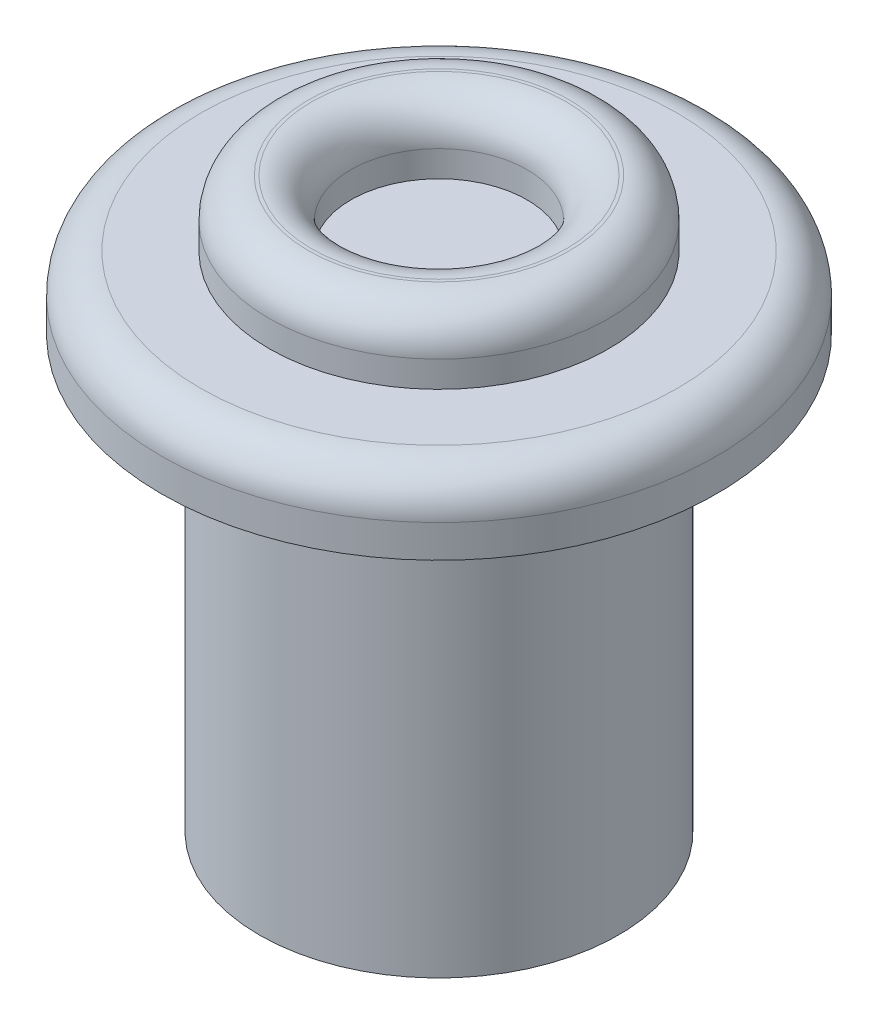
ISO-10303-21;
HEADER;
FILE_DESCRIPTION(('STEP AP214'),'2;1');
FILE_NAME('part.step','',(''),(''),'','','');
FILE_SCHEMA(('AUTOMOTIVE_DESIGN { 1 0 10303 214 1 1 1 1 }'));
ENDSEC;
DATA;
#1=APPLICATION_CONTEXT('core data for automotive mechanical design processes');
#2=APPLICATION_PROTOCOL_DEFINITION('international standard','automotive_design',2000,#1);
#3=PRODUCT_CONTEXT('',#1,'mechanical');
#4=PRODUCT('Part','Part','',(#3));
#5=PRODUCT_RELATED_PRODUCT_CATEGORY('part','',(#4));
#6=PRODUCT_DEFINITION_FORMATION('','',#4);
#7=PRODUCT_DEFINITION_CONTEXT('part definition',#1,'design');
#8=PRODUCT_DEFINITION('design','',#6,#7);
#9=PRODUCT_DEFINITION_SHAPE('','',#8);
#10=(LENGTH_UNIT() NAMED_UNIT(*) SI_UNIT(.MILLI.,.METRE.));
#11=(NAMED_UNIT(*) PLANE_ANGLE_UNIT() SI_UNIT($,.RADIAN.));
#12=(NAMED_UNIT(*) SI_UNIT($,.STERADIAN.) SOLID_ANGLE_UNIT());
#13=UNCERTAINTY_MEASURE_WITH_UNIT(LENGTH_MEASURE(1.E-05),#10,'distance_accuracy_value','');
#14=(GEOMETRIC_REPRESENTATION_CONTEXT(3) GLOBAL_UNCERTAINTY_ASSIGNED_CONTEXT((#13)) GLOBAL_UNIT_ASSIGNED_CONTEXT((#10,
#11,#12)) REPRESENTATION_CONTEXT('',''));
#15=CARTESIAN_POINT('',(0.,0.,0.));
#16=DIRECTION('',(0.,0.,1.));
#17=DIRECTION('',(1.,0.,0.));
#18=AXIS2_PLACEMENT_3D('',#15,#16,#17);
#19=CARTESIAN_POINT('',(0.,7.7,0.));
#20=DIRECTION('',(0.,1.,0.));
#21=DIRECTION('',(0.,0.,1.));
#22=AXIS2_PLACEMENT_3D('',#19,#20,#21);
#23=PLANE('',#22);
#24=CARTESIAN_POINT('',(0.,7.7,0.));
#25=DIRECTION('',(0.,1.,0.));
#26=DIRECTION('',(0.,0.,1.));
#27=AXIS2_PLACEMENT_3D('',#24,#25,#26);
#28=CIRCLE('',#27,3.65);
#29=CARTESIAN_POINT('',(0.,7.7,3.65));
#30=VERTEX_POINT('',#29);
#31=EDGE_CURVE('E38',#30,#30,#28,.T.);
#32=ORIENTED_EDGE('',*,*,#31,.T.);
#33=EDGE_LOOP('',(#32));
#34=FACE_BOUND('',#33,.T.);
#35=CARTESIAN_POINT('',(0.,7.7,0.));
#36=DIRECTION('',(0.,1.,0.));
#37=DIRECTION('',(0.,0.,1.));
#38=AXIS2_PLACEMENT_3D('',#35,#36,#37);
#39=CIRCLE('',#38,2.6);
#40=CARTESIAN_POINT('',(0.,7.7,2.6));
#41=VERTEX_POINT('',#40);
#42=EDGE_CURVE('E75',#41,#41,#39,.T.);
#43=ORIENTED_EDGE('',*,*,#42,.F.);
#44=EDGE_LOOP('',(#43));
#45=FACE_BOUND('',#44,.T.);
#46=ADVANCED_FACE('F31',(#34,#45),#23,.T.);
#47=CARTESIAN_POINT('',(0.,0.,0.));
#48=DIRECTION('',(0.,1.,0.));
#49=DIRECTION('',(0.,0.,1.));
#50=AXIS2_PLACEMENT_3D('',#47,#48,#49);
#51=PLANE('',#50);
#52=CARTESIAN_POINT('',(0.,0.,0.));
#53=DIRECTION('',(0.,1.,0.));
#54=DIRECTION('',(0.,0.,1.));
#55=AXIS2_PLACEMENT_3D('',#52,#53,#54);
#56=CIRCLE('',#55,2.75);
#57=CARTESIAN_POINT('',(0.,0.,2.75));
#58=VERTEX_POINT('',#57);
#59=EDGE_CURVE('E61',#58,#58,#56,.T.);
#60=ORIENTED_EDGE('',*,*,#59,.F.);
#61=EDGE_LOOP('',(#60));
#62=FACE_BOUND('',#61,.T.);
#63=CARTESIAN_POINT('',(0.,0.,0.));
#64=DIRECTION('',(0.,1.,0.));
#65=DIRECTION('',(0.,0.,1.));
#66=AXIS2_PLACEMENT_3D('',#63,#64,#65);
#67=CIRCLE('',#66,1.4);
#68=CARTESIAN_POINT('',(0.,0.,1.4));
#69=VERTEX_POINT('',#68);
#70=EDGE_CURVE('E64',#69,#69,#67,.T.);
#71=ORIENTED_EDGE('',*,*,#70,.T.);
#72=EDGE_LOOP('',(#71));
#73=FACE_BOUND('',#72,.T.);
#74=ADVANCED_FACE('F82',(#62,#73),#51,.F.);
#75=CARTESIAN_POINT('',(0.,6.6,0.));
#76=DIRECTION('',(0.,-1.,0.));
#77=DIRECTION('',(0.,0.,-1.));
#78=AXIS2_PLACEMENT_3D('',#75,#76,#77);
#79=CYLINDRICAL_SURFACE('',#78,2.75);
#80=CARTESIAN_POINT('',(0.,6.6,0.));
#81=DIRECTION('',(0.,1.,0.));
#82=DIRECTION('',(0.,0.,1.));
#83=AXIS2_PLACEMENT_3D('',#80,#81,#82);
#84=CIRCLE('',#83,2.75);
#85=CARTESIAN_POINT('',(0.,6.6,2.75));
#86=VERTEX_POINT('',#85);
#87=EDGE_CURVE('E60',#86,#86,#84,.T.);
#88=ORIENTED_EDGE('',*,*,#87,.F.);
#89=EDGE_LOOP('',(#88));
#90=FACE_BOUND('',#89,.T.);
#91=ORIENTED_EDGE('',*,*,#59,.T.);
#92=EDGE_LOOP('',(#91));
#93=FACE_BOUND('',#92,.T.);
#94=ADVANCED_FACE('F88',(#90,#93),#79,.T.);
#95=CARTESIAN_POINT('',(0.,6.6,0.));
#96=DIRECTION('',(0.,-1.,0.));
#97=DIRECTION('',(0.,0.,-1.));
#98=AXIS2_PLACEMENT_3D('',#95,#96,#97);
#99=CYLINDRICAL_SURFACE('',#98,1.4);
#100=CARTESIAN_POINT('',(0.,6.6,0.));
#101=DIRECTION('',(0.,1.,0.));
#102=DIRECTION('',(0.,0.,1.));
#103=AXIS2_PLACEMENT_3D('',#100,#101,#102);
#104=CIRCLE('',#103,1.4);
#105=CARTESIAN_POINT('',(0.,6.6,1.4));
#106=VERTEX_POINT('',#105);
#107=EDGE_CURVE('E69',#106,#106,#104,.T.);
#108=ORIENTED_EDGE('',*,*,#107,.T.);
#109=EDGE_LOOP('',(#108));
#110=FACE_BOUND('',#109,.T.);
#111=ORIENTED_EDGE('',*,*,#70,.F.);
#112=EDGE_LOOP('',(#111));
#113=FACE_BOUND('',#112,.T.);
#114=ADVANCED_FACE('F135',(#110,#113),#99,.F.);
#115=CARTESIAN_POINT('',(0.,6.6,0.));
#116=DIRECTION('',(0.,1.,0.));
#117=DIRECTION('',(0.,0.,1.));
#118=AXIS2_PLACEMENT_3D('',#115,#116,#117);
#119=PLANE('',#118);
#120=ORIENTED_EDGE('',*,*,#107,.F.);
#121=EDGE_LOOP('',(#120));
#122=FACE_BOUND('',#121,.T.);
#123=ADVANCED_FACE('F139',(#122),#119,.F.);
#124=CARTESIAN_POINT('',(0.,6.6,0.));
#125=DIRECTION('',(0.,1.,0.));
#126=DIRECTION('',(0.,0.,1.));
#127=AXIS2_PLACEMENT_3D('',#124,#125,#126);
#128=CIRCLE('',#127,4.25);
#129=CARTESIAN_POINT('',(0.,6.6,4.25));
#130=VERTEX_POINT('',#129);
#131=EDGE_CURVE('E72',#130,#130,#128,.T.);
#132=ORIENTED_EDGE('',*,*,#131,.F.);
#133=EDGE_LOOP('',(#132));
#134=FACE_BOUND('',#133,.T.);
#135=ORIENTED_EDGE('',*,*,#87,.T.);
#136=EDGE_LOOP('',(#135));
#137=FACE_BOUND('',#136,.T.);
#138=ADVANCED_FACE('F120',(#134,#137),#119,.F.);
#139=CARTESIAN_POINT('',(0.,7.7,0.));
#140=DIRECTION('',(0.,-1.,0.));
#141=DIRECTION('',(0.,0.,-1.));
#142=AXIS2_PLACEMENT_3D('',#139,#140,#141);
#143=CYLINDRICAL_SURFACE('',#142,4.25);
#144=CARTESIAN_POINT('',(0.,7.1,0.));
#145=DIRECTION('',(0.,1.,0.));
#146=DIRECTION('',(0.,0.,1.));
#147=AXIS2_PLACEMENT_3D('',#144,#145,#146);
#148=CIRCLE('',#147,4.25);
#149=CARTESIAN_POINT('',(0.,7.1,4.25));
#150=VERTEX_POINT('',#149);
#151=EDGE_CURVE('E10',#150,#150,#148,.F.);
#152=ORIENTED_EDGE('',*,*,#151,.T.);
#153=EDGE_LOOP('',(#152));
#154=FACE_BOUND('',#153,.T.);
#155=ORIENTED_EDGE('',*,*,#131,.T.);
#156=EDGE_LOOP('',(#155));
#157=FACE_BOUND('',#156,.T.);
#158=ADVANCED_FACE('F115',(#154,#157),#143,.T.);
#159=CARTESIAN_POINT('',(0.,8.7,0.));
#160=DIRECTION('',(0.,1.,0.));
#161=DIRECTION('',(0.,0.,1.));
#162=AXIS2_PLACEMENT_3D('',#159,#160,#161);
#163=PLANE('',#162);
#164=CARTESIAN_POINT('',(0.,8.7,0.));
#165=DIRECTION('',(0.,1.,0.));
#166=DIRECTION('',(0.,0.,1.));
#167=AXIS2_PLACEMENT_3D('',#164,#165,#166);
#168=CIRCLE('',#167,1.95);
#169=CARTESIAN_POINT('',(0.,8.7,1.95));
#170=VERTEX_POINT('',#169);
#171=EDGE_CURVE('E46',#170,#170,#168,.F.);
#172=ORIENTED_EDGE('',*,*,#171,.T.);
#173=EDGE_LOOP('',(#172));
#174=FACE_BOUND('',#173,.T.);
#175=CARTESIAN_POINT('',(0.,8.7,0.));
#176=DIRECTION('',(0.,1.,0.));
#177=DIRECTION('',(0.,0.,1.));
#178=AXIS2_PLACEMENT_3D('',#175,#176,#177);
#179=CIRCLE('',#178,2.);
#180=CARTESIAN_POINT('',(0.,8.7,2.));
#181=VERTEX_POINT('',#180);
#182=EDGE_CURVE('E51',#181,#181,#179,.T.);
#183=ORIENTED_EDGE('',*,*,#182,.T.);
#184=EDGE_LOOP('',(#183));
#185=FACE_BOUND('',#184,.T.);
#186=ADVANCED_FACE('F111',(#174,#185),#163,.T.);
#187=CARTESIAN_POINT('',(0.,8.7,0.));
#188=DIRECTION('',(0.,-1.,0.));
#189=DIRECTION('',(0.,0.,-1.));
#190=AXIS2_PLACEMENT_3D('',#187,#188,#189);
#191=CYLINDRICAL_SURFACE('',#190,2.6);
#192=CARTESIAN_POINT('',(0.,8.1,0.));
#193=DIRECTION('',(0.,1.,0.));
#194=DIRECTION('',(0.,0.,1.));
#195=AXIS2_PLACEMENT_3D('',#192,#193,#194);
#196=CIRCLE('',#195,2.6);
#197=CARTESIAN_POINT('',(0.,8.1,2.6));
#198=VERTEX_POINT('',#197);
#199=EDGE_CURVE('E42',#198,#198,#196,.F.);
#200=ORIENTED_EDGE('',*,*,#199,.T.);
#201=EDGE_LOOP('',(#200));
#202=FACE_BOUND('',#201,.T.);
#203=ORIENTED_EDGE('',*,*,#42,.T.);
#204=EDGE_LOOP('',(#203));
#205=FACE_BOUND('',#204,.T.);
#206=ADVANCED_FACE('F79',(#202,#205),#191,.T.);
#207=CARTESIAN_POINT('',(0.,8.7,0.));
#208=DIRECTION('',(0.,-1.,0.));
#209=DIRECTION('',(0.,0.,-1.));
#210=AXIS2_PLACEMENT_3D('',#207,#208,#209);
#211=CYLINDRICAL_SURFACE('',#210,1.35);
#212=CARTESIAN_POINT('',(0.,8.1,0.));
#213=DIRECTION('',(0.,1.,0.));
#214=DIRECTION('',(0.,0.,1.));
#215=AXIS2_PLACEMENT_3D('',#212,#213,#214);
#216=CIRCLE('',#215,1.35);
#217=CARTESIAN_POINT('',(0.,8.1,1.35));
#218=VERTEX_POINT('',#217);
#219=EDGE_CURVE('E54',#218,#218,#216,.T.);
#220=ORIENTED_EDGE('',*,*,#219,.T.);
#221=EDGE_LOOP('',(#220));
#222=FACE_BOUND('',#221,.T.);
#223=CARTESIAN_POINT('',(0.,7.7,0.));
#224=DIRECTION('',(0.,1.,0.));
#225=DIRECTION('',(0.,0.,1.));
#226=AXIS2_PLACEMENT_3D('',#223,#224,#225);
#227=CIRCLE('',#226,1.35);
#228=CARTESIAN_POINT('',(0.,7.7,1.35));
#229=VERTEX_POINT('',#228);
#230=EDGE_CURVE('E57',#229,#229,#227,.F.);
#231=ORIENTED_EDGE('',*,*,#230,.T.);
#232=EDGE_LOOP('',(#231));
#233=FACE_BOUND('',#232,.T.);
#234=ADVANCED_FACE('F95',(#222,#233),#211,.F.);
#235=ORIENTED_EDGE('',*,*,#230,.F.);
#236=EDGE_LOOP('',(#235));
#237=FACE_BOUND('',#236,.T.);
#238=ADVANCED_FACE('F84',(#237),#23,.T.);
#239=CARTESIAN_POINT('',(0.,8.1,0.));
#240=DIRECTION('',(0.,1.,0.));
#241=DIRECTION('',(0.,0.,1.));
#242=AXIS2_PLACEMENT_3D('',#239,#240,#241);
#243=TOROIDAL_SURFACE('',#242,1.95,0.6);
#244=ORIENTED_EDGE('',*,*,#171,.F.);
#245=EDGE_LOOP('',(#244));
#246=FACE_BOUND('',#245,.T.);
#247=ORIENTED_EDGE('',*,*,#219,.F.);
#248=EDGE_LOOP('',(#247));
#249=FACE_BOUND('',#248,.T.);
#250=ADVANCED_FACE('F94',(#246,#249),#243,.T.);
#251=CARTESIAN_POINT('',(0.,8.1,0.));
#252=DIRECTION('',(0.,1.,0.));
#253=DIRECTION('',(0.,0.,1.));
#254=AXIS2_PLACEMENT_3D('',#251,#252,#253);
#255=TOROIDAL_SURFACE('',#254,2.,0.6);
#256=ORIENTED_EDGE('',*,*,#199,.F.);
#257=EDGE_LOOP('',(#256));
#258=FACE_BOUND('',#257,.T.);
#259=ORIENTED_EDGE('',*,*,#182,.F.);
#260=EDGE_LOOP('',(#259));
#261=FACE_BOUND('',#260,.T.);
#262=ADVANCED_FACE('F101',(#258,#261),#255,.T.);
#263=CARTESIAN_POINT('',(0.,7.1,0.));
#264=DIRECTION('',(0.,1.,0.));
#265=DIRECTION('',(0.,0.,1.));
#266=AXIS2_PLACEMENT_3D('',#263,#264,#265);
#267=TOROIDAL_SURFACE('',#266,3.65,0.6);
#268=ORIENTED_EDGE('',*,*,#151,.F.);
#269=EDGE_LOOP('',(#268));
#270=FACE_BOUND('',#269,.T.);
#271=ORIENTED_EDGE('',*,*,#31,.F.);
#272=EDGE_LOOP('',(#271));
#273=FACE_BOUND('',#272,.T.);
#274=ADVANCED_FACE('F33',(#270,#273),#267,.T.);
#275=CLOSED_SHELL('',(#46,#74,#94,#114,#123,#138,#158,#186,#206,#234,#238,#250,#262,#274));
#276=MANIFOLD_SOLID_BREP('B2',#275);
#277=ADVANCED_BREP_SHAPE_REPRESENTATION('',(#18,#276),#14);
#278=SHAPE_DEFINITION_REPRESENTATION(#9,#277);
ENDSEC;
END-ISO-10303-21;
